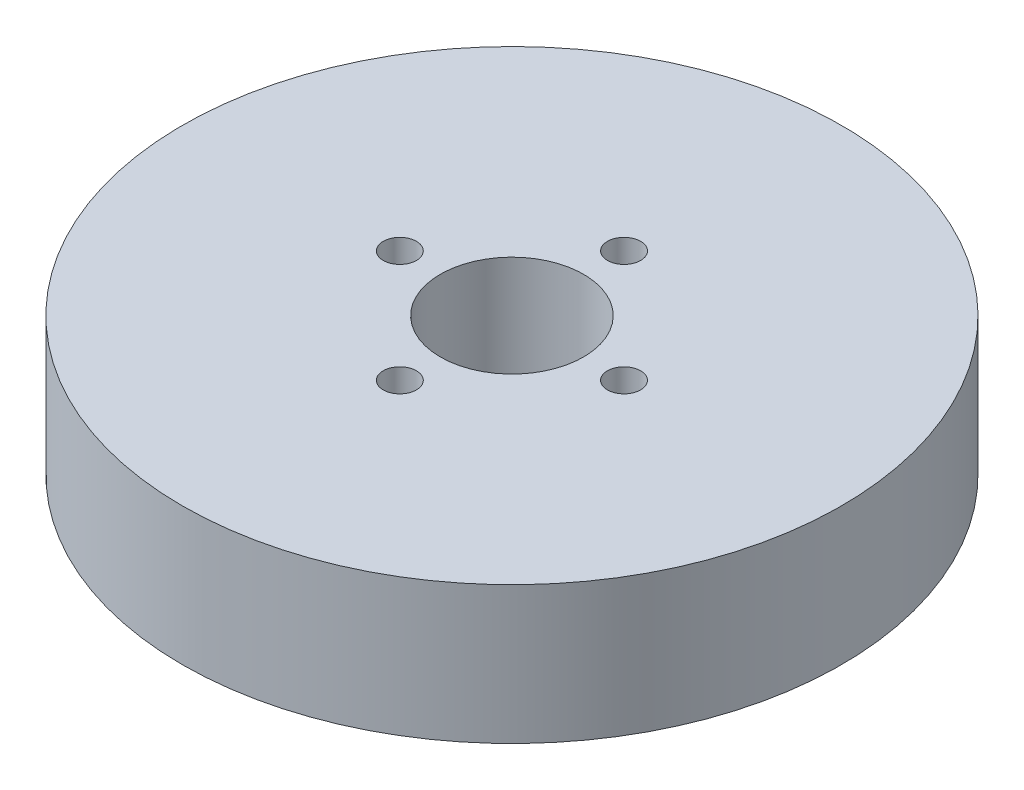
ISO-10303-21;
HEADER;
FILE_DESCRIPTION(('STEP AP214'),'2;1');
FILE_NAME('part.step','',(''),(''),'','','');
FILE_SCHEMA(('AUTOMOTIVE_DESIGN { 1 0 10303 214 1 1 1 1 }'));
ENDSEC;
DATA;
#1=APPLICATION_CONTEXT('core data for automotive mechanical design processes');
#2=APPLICATION_PROTOCOL_DEFINITION('international standard','automotive_design',2000,#1);
#3=PRODUCT_CONTEXT('',#1,'mechanical');
#4=PRODUCT('Part','Part','',(#3));
#5=PRODUCT_RELATED_PRODUCT_CATEGORY('part','',(#4));
#6=PRODUCT_DEFINITION_FORMATION('','',#4);
#7=PRODUCT_DEFINITION_CONTEXT('part definition',#1,'design');
#8=PRODUCT_DEFINITION('design','',#6,#7);
#9=PRODUCT_DEFINITION_SHAPE('','',#8);
#10=(LENGTH_UNIT() NAMED_UNIT(*) SI_UNIT(.MILLI.,.METRE.));
#11=(NAMED_UNIT(*) PLANE_ANGLE_UNIT() SI_UNIT($,.RADIAN.));
#12=(NAMED_UNIT(*) SI_UNIT($,.STERADIAN.) SOLID_ANGLE_UNIT());
#13=UNCERTAINTY_MEASURE_WITH_UNIT(LENGTH_MEASURE(1.E-05),#10,'distance_accuracy_value','');
#14=(GEOMETRIC_REPRESENTATION_CONTEXT(3) GLOBAL_UNCERTAINTY_ASSIGNED_CONTEXT((#13)) GLOBAL_UNIT_ASSIGNED_CONTEXT((#10,
#11,#12)) REPRESENTATION_CONTEXT('',''));
#15=CARTESIAN_POINT('',(0.,0.,0.));
#16=DIRECTION('',(0.,0.,1.));
#17=DIRECTION('',(1.,0.,0.));
#18=AXIS2_PLACEMENT_3D('',#15,#16,#17);
#19=CARTESIAN_POINT('',(0.,24.,0.));
#20=DIRECTION('',(0.,-1.,0.));
#21=DIRECTION('',(0.,0.,-1.));
#22=AXIS2_PLACEMENT_3D('',#19,#20,#21);
#23=CYLINDRICAL_SURFACE('',#22,57.5);
#24=CARTESIAN_POINT('',(0.,24.,0.));
#25=DIRECTION('',(0.,1.,0.));
#26=DIRECTION('',(0.,0.,1.));
#27=AXIS2_PLACEMENT_3D('',#24,#25,#26);
#28=CIRCLE('',#27,57.5);
#29=CARTESIAN_POINT('',(0.,24.,57.5));
#30=VERTEX_POINT('',#29);
#31=EDGE_CURVE('E10',#30,#30,#28,.T.);
#32=ORIENTED_EDGE('',*,*,#31,.F.);
#33=EDGE_LOOP('',(#32));
#34=FACE_BOUND('',#33,.T.);
#35=CARTESIAN_POINT('',(0.,0.,0.));
#36=DIRECTION('',(0.,1.,0.));
#37=DIRECTION('',(0.,0.,1.));
#38=AXIS2_PLACEMENT_3D('',#35,#36,#37);
#39=CIRCLE('',#38,57.5);
#40=CARTESIAN_POINT('',(0.,0.,57.5));
#41=VERTEX_POINT('',#40);
#42=EDGE_CURVE('E37',#41,#41,#39,.T.);
#43=ORIENTED_EDGE('',*,*,#42,.T.);
#44=EDGE_LOOP('',(#43));
#45=FACE_BOUND('',#44,.T.);
#46=ADVANCED_FACE('F40',(#34,#45),#23,.T.);
#47=CARTESIAN_POINT('',(0.,24.,0.));
#48=DIRECTION('',(0.,1.,0.));
#49=DIRECTION('',(0.,0.,1.));
#50=AXIS2_PLACEMENT_3D('',#47,#48,#49);
#51=PLANE('',#50);
#52=CARTESIAN_POINT('',(0.,24.,19.5589343700802));
#53=DIRECTION('',(0.,1.,0.));
#54=DIRECTION('',(1.,0.,0.));
#55=AXIS2_PLACEMENT_3D('',#52,#53,#54);
#56=CIRCLE('',#55,2.89686640848393);
#57=CARTESIAN_POINT('',(2.896866408484,24.,19.5589343700802));
#58=VERTEX_POINT('',#57);
#59=EDGE_CURVE('E71',#58,#58,#56,.T.);
#60=ORIENTED_EDGE('',*,*,#59,.F.);
#61=EDGE_LOOP('',(#60));
#62=FACE_BOUND('',#61,.T.);
#63=CARTESIAN_POINT('',(19.5589343700802,24.,0.));
#64=DIRECTION('',(0.,1.,0.));
#65=DIRECTION('',(0.,0.,-1.));
#66=AXIS2_PLACEMENT_3D('',#63,#64,#65);
#67=CIRCLE('',#66,2.89686640848393);
#68=CARTESIAN_POINT('',(19.5589343700802,24.,-2.89686640848393));
#69=VERTEX_POINT('',#68);
#70=EDGE_CURVE('E70',#69,#69,#67,.T.);
#71=ORIENTED_EDGE('',*,*,#70,.F.);
#72=EDGE_LOOP('',(#71));
#73=FACE_BOUND('',#72,.T.);
#74=CARTESIAN_POINT('',(-2.04868963082378E-13,24.,-19.5589343700802));
#75=DIRECTION('',(0.,1.,0.));
#76=DIRECTION('',(-1.,0.,0.));
#77=AXIS2_PLACEMENT_3D('',#74,#75,#76);
#78=CIRCLE('',#77,2.89686640848393);
#79=CARTESIAN_POINT('',(-2.89686640848414,24.,-19.5589343700802));
#80=VERTEX_POINT('',#79);
#81=EDGE_CURVE('E61',#80,#80,#78,.T.);
#82=ORIENTED_EDGE('',*,*,#81,.F.);
#83=EDGE_LOOP('',(#82));
#84=FACE_BOUND('',#83,.T.);
#85=CARTESIAN_POINT('',(-19.5589343700802,24.,0.));
#86=DIRECTION('',(0.,1.,0.));
#87=DIRECTION('',(0.,0.,1.));
#88=AXIS2_PLACEMENT_3D('',#85,#86,#87);
#89=CIRCLE('',#88,2.89686640848393);
#90=CARTESIAN_POINT('',(-19.5589343700802,24.,2.89686640848393));
#91=VERTEX_POINT('',#90);
#92=EDGE_CURVE('E54',#91,#91,#89,.T.);
#93=ORIENTED_EDGE('',*,*,#92,.F.);
#94=EDGE_LOOP('',(#93));
#95=FACE_BOUND('',#94,.T.);
#96=CARTESIAN_POINT('',(0.,24.,0.));
#97=DIRECTION('',(0.,1.,0.));
#98=DIRECTION('',(0.,0.,1.));
#99=AXIS2_PLACEMENT_3D('',#96,#97,#98);
#100=CIRCLE('',#99,12.5);
#101=CARTESIAN_POINT('',(0.,24.,12.5));
#102=VERTEX_POINT('',#101);
#103=EDGE_CURVE('E50',#102,#102,#100,.T.);
#104=ORIENTED_EDGE('',*,*,#103,.F.);
#105=EDGE_LOOP('',(#104));
#106=FACE_BOUND('',#105,.T.);
#107=ORIENTED_EDGE('',*,*,#31,.T.);
#108=EDGE_LOOP('',(#107));
#109=FACE_BOUND('',#108,.T.);
#110=ADVANCED_FACE('F86',(#62,#73,#84,#95,#106,#109),#51,.T.);
#111=CARTESIAN_POINT('',(0.,0.,0.));
#112=DIRECTION('',(0.,1.,0.));
#113=DIRECTION('',(0.,0.,1.));
#114=AXIS2_PLACEMENT_3D('',#111,#112,#113);
#115=PLANE('',#114);
#116=CARTESIAN_POINT('',(0.,0.,0.));
#117=DIRECTION('',(0.,1.,0.));
#118=DIRECTION('',(0.,0.,1.));
#119=AXIS2_PLACEMENT_3D('',#116,#117,#118);
#120=CIRCLE('',#119,12.5);
#121=CARTESIAN_POINT('',(0.,0.,12.5));
#122=VERTEX_POINT('',#121);
#123=EDGE_CURVE('E47',#122,#122,#120,.T.);
#124=ORIENTED_EDGE('',*,*,#123,.T.);
#125=EDGE_LOOP('',(#124));
#126=FACE_BOUND('',#125,.T.);
#127=ORIENTED_EDGE('',*,*,#42,.F.);
#128=EDGE_LOOP('',(#127));
#129=FACE_BOUND('',#128,.T.);
#130=ADVANCED_FACE('F93',(#126,#129),#115,.F.);
#131=CARTESIAN_POINT('',(0.,24.,0.));
#132=DIRECTION('',(0.,-1.,0.));
#133=DIRECTION('',(0.,0.,-1.));
#134=AXIS2_PLACEMENT_3D('',#131,#132,#133);
#135=CYLINDRICAL_SURFACE('',#134,12.5);
#136=ORIENTED_EDGE('',*,*,#103,.T.);
#137=EDGE_LOOP('',(#136));
#138=FACE_BOUND('',#137,.T.);
#139=ORIENTED_EDGE('',*,*,#123,.F.);
#140=EDGE_LOOP('',(#139));
#141=FACE_BOUND('',#140,.T.);
#142=ADVANCED_FACE('F101',(#138,#141),#135,.F.);
#143=CARTESIAN_POINT('',(-19.5589343700802,4.90167334526572,0.));
#144=DIRECTION('',(0.,1.,0.));
#145=DIRECTION('',(0.,0.,1.));
#146=AXIS2_PLACEMENT_3D('',#143,#144,#145);
#147=CYLINDRICAL_SURFACE('',#146,2.89686640848393);
#148=CARTESIAN_POINT('',(-19.5589343700802,4.90167334526572,0.));
#149=DIRECTION('',(0.,1.,0.));
#150=DIRECTION('',(0.,0.,1.));
#151=AXIS2_PLACEMENT_3D('',#148,#149,#150);
#152=CIRCLE('',#151,2.89686640848393);
#153=CARTESIAN_POINT('',(-19.5589343700802,4.90167334526572,2.89686640848393));
#154=VERTEX_POINT('',#153);
#155=EDGE_CURVE('E55',#154,#154,#152,.T.);
#156=ORIENTED_EDGE('',*,*,#155,.F.);
#157=EDGE_LOOP('',(#156));
#158=FACE_BOUND('',#157,.T.);
#159=ORIENTED_EDGE('',*,*,#92,.T.);
#160=EDGE_LOOP('',(#159));
#161=FACE_BOUND('',#160,.T.);
#162=ADVANCED_FACE('F102',(#158,#161),#147,.F.);
#163=CARTESIAN_POINT('',(-19.5589343700802,4.90167334526572,0.));
#164=DIRECTION('',(0.,1.,0.));
#165=DIRECTION('',(0.,0.,1.));
#166=AXIS2_PLACEMENT_3D('',#163,#164,#165);
#167=PLANE('',#166);
#168=ORIENTED_EDGE('',*,*,#155,.T.);
#169=EDGE_LOOP('',(#168));
#170=FACE_BOUND('',#169,.T.);
#171=ADVANCED_FACE('F133',(#170),#167,.T.);
#172=CARTESIAN_POINT('',(-2.04868963082378E-13,4.90167334526572,-19.5589343700802));
#173=DIRECTION('',(0.,1.,0.));
#174=DIRECTION('',(0.,0.,1.));
#175=AXIS2_PLACEMENT_3D('',#172,#173,#174);
#176=CYLINDRICAL_SURFACE('',#175,2.89686640848393);
#177=CARTESIAN_POINT('',(-2.04868963082378E-13,4.90167334526572,-19.5589343700802));
#178=DIRECTION('',(0.,1.,0.));
#179=DIRECTION('',(-1.,0.,0.));
#180=AXIS2_PLACEMENT_3D('',#177,#178,#179);
#181=CIRCLE('',#180,2.89686640848393);
#182=CARTESIAN_POINT('',(-2.89686640848414,4.90167334526572,-19.5589343700802));
#183=VERTEX_POINT('',#182);
#184=EDGE_CURVE('E63',#183,#183,#181,.T.);
#185=ORIENTED_EDGE('',*,*,#184,.F.);
#186=EDGE_LOOP('',(#185));
#187=FACE_BOUND('',#186,.T.);
#188=ORIENTED_EDGE('',*,*,#81,.T.);
#189=EDGE_LOOP('',(#188));
#190=FACE_BOUND('',#189,.T.);
#191=ADVANCED_FACE('F142',(#187,#190),#176,.F.);
#192=CARTESIAN_POINT('',(-2.04868963082378E-13,4.90167334526572,-19.5589343700802));
#193=DIRECTION('',(0.,1.,0.));
#194=DIRECTION('',(-1.,0.,0.));
#195=AXIS2_PLACEMENT_3D('',#192,#193,#194);
#196=PLANE('',#195);
#197=ORIENTED_EDGE('',*,*,#184,.T.);
#198=EDGE_LOOP('',(#197));
#199=FACE_BOUND('',#198,.T.);
#200=ADVANCED_FACE('F156',(#199),#196,.T.);
#201=CARTESIAN_POINT('',(19.5589343700802,4.90167334526572,0.));
#202=DIRECTION('',(0.,1.,0.));
#203=DIRECTION('',(0.,0.,1.));
#204=AXIS2_PLACEMENT_3D('',#201,#202,#203);
#205=CYLINDRICAL_SURFACE('',#204,2.89686640848393);
#206=CARTESIAN_POINT('',(19.5589343700802,4.90167334526572,0.));
#207=DIRECTION('',(0.,1.,0.));
#208=DIRECTION('',(0.,0.,-1.));
#209=AXIS2_PLACEMENT_3D('',#206,#207,#208);
#210=CIRCLE('',#209,2.89686640848393);
#211=CARTESIAN_POINT('',(19.5589343700802,4.90167334526572,-2.89686640848393));
#212=VERTEX_POINT('',#211);
#213=EDGE_CURVE('E69',#212,#212,#210,.T.);
#214=ORIENTED_EDGE('',*,*,#213,.F.);
#215=EDGE_LOOP('',(#214));
#216=FACE_BOUND('',#215,.T.);
#217=ORIENTED_EDGE('',*,*,#70,.T.);
#218=EDGE_LOOP('',(#217));
#219=FACE_BOUND('',#218,.T.);
#220=ADVANCED_FACE('F164',(#216,#219),#205,.F.);
#221=CARTESIAN_POINT('',(19.5589343700802,4.90167334526572,0.));
#222=DIRECTION('',(0.,1.,0.));
#223=DIRECTION('',(0.,0.,-1.));
#224=AXIS2_PLACEMENT_3D('',#221,#222,#223);
#225=PLANE('',#224);
#226=ORIENTED_EDGE('',*,*,#213,.T.);
#227=EDGE_LOOP('',(#226));
#228=FACE_BOUND('',#227,.T.);
#229=ADVANCED_FACE('F83',(#228),#225,.T.);
#230=CARTESIAN_POINT('',(0.,4.90167334526572,19.5589343700802));
#231=DIRECTION('',(0.,1.,0.));
#232=DIRECTION('',(0.,0.,1.));
#233=AXIS2_PLACEMENT_3D('',#230,#231,#232);
#234=CYLINDRICAL_SURFACE('',#233,2.89686640848393);
#235=CARTESIAN_POINT('',(0.,4.90167334526572,19.5589343700802));
#236=DIRECTION('',(0.,1.,0.));
#237=DIRECTION('',(1.,0.,0.));
#238=AXIS2_PLACEMENT_3D('',#235,#236,#237);
#239=CIRCLE('',#238,2.89686640848393);
#240=CARTESIAN_POINT('',(2.896866408484,4.90167334526572,19.5589343700802));
#241=VERTEX_POINT('',#240);
#242=EDGE_CURVE('E59',#241,#241,#239,.T.);
#243=ORIENTED_EDGE('',*,*,#242,.F.);
#244=EDGE_LOOP('',(#243));
#245=FACE_BOUND('',#244,.T.);
#246=ORIENTED_EDGE('',*,*,#59,.T.);
#247=EDGE_LOOP('',(#246));
#248=FACE_BOUND('',#247,.T.);
#249=ADVANCED_FACE('F81',(#245,#248),#234,.F.);
#250=CARTESIAN_POINT('',(0.,4.90167334526572,19.5589343700802));
#251=DIRECTION('',(0.,1.,0.));
#252=DIRECTION('',(1.,0.,0.));
#253=AXIS2_PLACEMENT_3D('',#250,#251,#252);
#254=PLANE('',#253);
#255=ORIENTED_EDGE('',*,*,#242,.T.);
#256=EDGE_LOOP('',(#255));
#257=FACE_BOUND('',#256,.T.);
#258=ADVANCED_FACE('F78',(#257),#254,.T.);
#259=CLOSED_SHELL('',(#46,#110,#130,#142,#162,#171,#191,#200,#220,#229,#249,#258));
#260=MANIFOLD_SOLID_BREP('B2',#259);
#261=ADVANCED_BREP_SHAPE_REPRESENTATION('',(#18,#260),#14);
#262=SHAPE_DEFINITION_REPRESENTATION(#9,#261);
ENDSEC;
END-ISO-10303-21;
